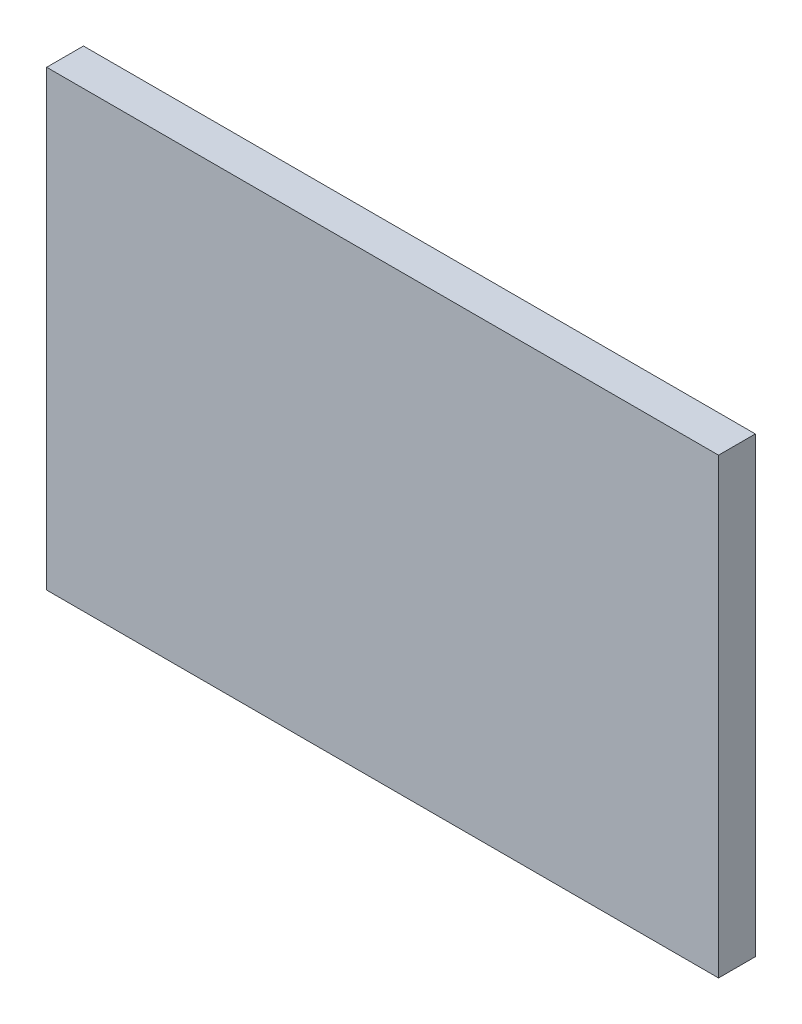
ISO-10303-21;
HEADER;
FILE_DESCRIPTION(('STEP AP214'),'2;1');
FILE_NAME('part.step','',(''),(''),'','','');
FILE_SCHEMA(('AUTOMOTIVE_DESIGN { 1 0 10303 214 1 1 1 1 }'));
ENDSEC;
DATA;
#1=APPLICATION_CONTEXT('core data for automotive mechanical design processes');
#2=APPLICATION_PROTOCOL_DEFINITION('international standard','automotive_design',2000,#1);
#3=PRODUCT_CONTEXT('',#1,'mechanical');
#4=PRODUCT('Part','Part','',(#3));
#5=PRODUCT_RELATED_PRODUCT_CATEGORY('part','',(#4));
#6=PRODUCT_DEFINITION_FORMATION('','',#4);
#7=PRODUCT_DEFINITION_CONTEXT('part definition',#1,'design');
#8=PRODUCT_DEFINITION('design','',#6,#7);
#9=PRODUCT_DEFINITION_SHAPE('','',#8);
#10=(LENGTH_UNIT() NAMED_UNIT(*) SI_UNIT(.MILLI.,.METRE.));
#11=(NAMED_UNIT(*) PLANE_ANGLE_UNIT() SI_UNIT($,.RADIAN.));
#12=(NAMED_UNIT(*) SI_UNIT($,.STERADIAN.) SOLID_ANGLE_UNIT());
#13=UNCERTAINTY_MEASURE_WITH_UNIT(LENGTH_MEASURE(1.E-05),#10,'distance_accuracy_value','');
#14=(GEOMETRIC_REPRESENTATION_CONTEXT(3) GLOBAL_UNCERTAINTY_ASSIGNED_CONTEXT((#13)) GLOBAL_UNIT_ASSIGNED_CONTEXT((#10,
#11,#12)) REPRESENTATION_CONTEXT('',''));
#15=CARTESIAN_POINT('',(0.,0.,0.));
#16=DIRECTION('',(0.,0.,1.));
#17=DIRECTION('',(1.,0.,0.));
#18=AXIS2_PLACEMENT_3D('',#15,#16,#17);
#19=CARTESIAN_POINT('',(-14.605,-9.8425,1.6));
#20=DIRECTION('',(1.,0.,0.));
#21=DIRECTION('',(0.,0.,-1.));
#22=AXIS2_PLACEMENT_3D('',#19,#20,#21);
#23=PLANE('',#22);
#24=DIRECTION('',(0.,-1.,0.));
#25=VECTOR('',#24,1.);
#26=CARTESIAN_POINT('',(-14.605,-9.8425,0.));
#27=LINE('',#26,#25);
#28=CARTESIAN_POINT('',(-14.605,9.8425,0.));
#29=VERTEX_POINT('',#28);
#30=CARTESIAN_POINT('',(-14.605,-9.8425,0.));
#31=VERTEX_POINT('',#30);
#32=EDGE_CURVE('E107',#29,#31,#27,.T.);
#33=ORIENTED_EDGE('',*,*,#32,.T.);
#34=DIRECTION('',(0.,0.,-1.));
#35=VECTOR('',#34,1.);
#36=CARTESIAN_POINT('',(-14.605,-9.8425,1.6));
#37=LINE('',#36,#35);
#38=CARTESIAN_POINT('',(-14.605,-9.8425,1.6));
#39=VERTEX_POINT('',#38);
#40=EDGE_CURVE('E11',#39,#31,#37,.T.);
#41=ORIENTED_EDGE('',*,*,#40,.F.);
#42=DIRECTION('',(0.,-1.,0.));
#43=VECTOR('',#42,1.);
#44=CARTESIAN_POINT('',(-14.605,-9.8425,1.6));
#45=LINE('',#44,#43);
#46=CARTESIAN_POINT('',(-14.605,9.8425,1.6));
#47=VERTEX_POINT('',#46);
#48=EDGE_CURVE('E91',#47,#39,#45,.T.);
#49=ORIENTED_EDGE('',*,*,#48,.F.);
#50=DIRECTION('',(0.,0.,-1.));
#51=VECTOR('',#50,1.);
#52=CARTESIAN_POINT('',(-14.605,9.8425,1.6));
#53=LINE('',#52,#51);
#54=EDGE_CURVE('E103',#47,#29,#53,.T.);
#55=ORIENTED_EDGE('',*,*,#54,.T.);
#56=EDGE_LOOP('',(#33,#41,#49,#55));
#57=FACE_BOUND('',#56,.T.);
#58=ADVANCED_FACE('F39',(#57),#23,.F.);
#59=CARTESIAN_POINT('',(14.605,-9.8425,1.6));
#60=DIRECTION('',(0.,1.,0.));
#61=DIRECTION('',(-1.,0.,0.));
#62=AXIS2_PLACEMENT_3D('',#59,#60,#61);
#63=PLANE('',#62);
#64=DIRECTION('',(1.,0.,0.));
#65=VECTOR('',#64,1.);
#66=CARTESIAN_POINT('',(14.605,-9.8425,0.));
#67=LINE('',#66,#65);
#68=CARTESIAN_POINT('',(14.605,-9.8425,0.));
#69=VERTEX_POINT('',#68);
#70=EDGE_CURVE('E96',#31,#69,#67,.T.);
#71=ORIENTED_EDGE('',*,*,#70,.T.);
#72=DIRECTION('',(0.,0.,-1.));
#73=VECTOR('',#72,1.);
#74=CARTESIAN_POINT('',(14.605,-9.8425,1.6));
#75=LINE('',#74,#73);
#76=CARTESIAN_POINT('',(14.605,-9.8425,1.6));
#77=VERTEX_POINT('',#76);
#78=EDGE_CURVE('E48',#77,#69,#75,.T.);
#79=ORIENTED_EDGE('',*,*,#78,.F.);
#80=DIRECTION('',(1.,0.,0.));
#81=VECTOR('',#80,1.);
#82=CARTESIAN_POINT('',(14.605,-9.8425,1.6));
#83=LINE('',#82,#81);
#84=EDGE_CURVE('E86',#39,#77,#83,.T.);
#85=ORIENTED_EDGE('',*,*,#84,.F.);
#86=ORIENTED_EDGE('',*,*,#40,.T.);
#87=EDGE_LOOP('',(#71,#79,#85,#86));
#88=FACE_BOUND('',#87,.T.);
#89=ADVANCED_FACE('F95',(#88),#63,.F.);
#90=CARTESIAN_POINT('',(14.605,-9.8425,1.6));
#91=DIRECTION('',(-1.,0.,0.));
#92=DIRECTION('',(0.,-1.,0.));
#93=AXIS2_PLACEMENT_3D('',#90,#91,#92);
#94=PLANE('',#93);
#95=DIRECTION('',(0.,1.,0.));
#96=VECTOR('',#95,1.);
#97=CARTESIAN_POINT('',(14.605,-9.8425,0.));
#98=LINE('',#97,#96);
#99=CARTESIAN_POINT('',(14.605,9.8425,0.));
#100=VERTEX_POINT('',#99);
#101=EDGE_CURVE('E73',#69,#100,#98,.T.);
#102=ORIENTED_EDGE('',*,*,#101,.T.);
#103=DIRECTION('',(0.,0.,-1.));
#104=VECTOR('',#103,1.);
#105=CARTESIAN_POINT('',(14.605,9.8425,1.6));
#106=LINE('',#105,#104);
#107=CARTESIAN_POINT('',(14.605,9.8425,1.6));
#108=VERTEX_POINT('',#107);
#109=EDGE_CURVE('E98',#108,#100,#106,.T.);
#110=ORIENTED_EDGE('',*,*,#109,.F.);
#111=DIRECTION('',(0.,1.,0.));
#112=VECTOR('',#111,1.);
#113=CARTESIAN_POINT('',(14.605,-9.8425,1.6));
#114=LINE('',#113,#112);
#115=EDGE_CURVE('E89',#77,#108,#114,.T.);
#116=ORIENTED_EDGE('',*,*,#115,.F.);
#117=ORIENTED_EDGE('',*,*,#78,.T.);
#118=EDGE_LOOP('',(#102,#110,#116,#117));
#119=FACE_BOUND('',#118,.T.);
#120=ADVANCED_FACE('F99',(#119),#94,.F.);
#121=CARTESIAN_POINT('',(14.605,9.8425,1.6));
#122=DIRECTION('',(0.,-1.,0.));
#123=DIRECTION('',(1.,0.,0.));
#124=AXIS2_PLACEMENT_3D('',#121,#122,#123);
#125=PLANE('',#124);
#126=DIRECTION('',(-1.,0.,0.));
#127=VECTOR('',#126,1.);
#128=CARTESIAN_POINT('',(14.605,9.8425,0.));
#129=LINE('',#128,#127);
#130=EDGE_CURVE('E79',#100,#29,#129,.T.);
#131=ORIENTED_EDGE('',*,*,#130,.T.);
#132=ORIENTED_EDGE('',*,*,#54,.F.);
#133=DIRECTION('',(-1.,0.,0.));
#134=VECTOR('',#133,1.);
#135=CARTESIAN_POINT('',(14.605,9.8425,1.6));
#136=LINE('',#135,#134);
#137=EDGE_CURVE('E56',#108,#47,#136,.T.);
#138=ORIENTED_EDGE('',*,*,#137,.F.);
#139=ORIENTED_EDGE('',*,*,#109,.T.);
#140=EDGE_LOOP('',(#131,#132,#138,#139));
#141=FACE_BOUND('',#140,.T.);
#142=ADVANCED_FACE('F120',(#141),#125,.F.);
#143=CARTESIAN_POINT('',(0.,0.,1.6));
#144=DIRECTION('',(0.,0.,1.));
#145=DIRECTION('',(1.,0.,0.));
#146=AXIS2_PLACEMENT_3D('',#143,#144,#145);
#147=PLANE('',#146);
#148=ORIENTED_EDGE('',*,*,#48,.T.);
#149=ORIENTED_EDGE('',*,*,#84,.T.);
#150=ORIENTED_EDGE('',*,*,#115,.T.);
#151=ORIENTED_EDGE('',*,*,#137,.T.);
#152=EDGE_LOOP('',(#148,#149,#150,#151));
#153=FACE_BOUND('',#152,.T.);
#154=ADVANCED_FACE('F87',(#153),#147,.T.);
#155=CARTESIAN_POINT('',(0.,0.,0.));
#156=DIRECTION('',(0.,0.,1.));
#157=DIRECTION('',(1.,0.,0.));
#158=AXIS2_PLACEMENT_3D('',#155,#156,#157);
#159=PLANE('',#158);
#160=ORIENTED_EDGE('',*,*,#32,.F.);
#161=ORIENTED_EDGE('',*,*,#130,.F.);
#162=ORIENTED_EDGE('',*,*,#101,.F.);
#163=ORIENTED_EDGE('',*,*,#70,.F.);
#164=EDGE_LOOP('',(#160,#161,#162,#163));
#165=FACE_BOUND('',#164,.T.);
#166=ADVANCED_FACE('F123',(#165),#159,.F.);
#167=CLOSED_SHELL('',(#58,#89,#120,#142,#154,#166));
#168=MANIFOLD_SOLID_BREP('B2',#167);
#169=ADVANCED_BREP_SHAPE_REPRESENTATION('',(#18,#168),#14);
#170=SHAPE_DEFINITION_REPRESENTATION(#9,#169);
ENDSEC;
END-ISO-10303-21;
